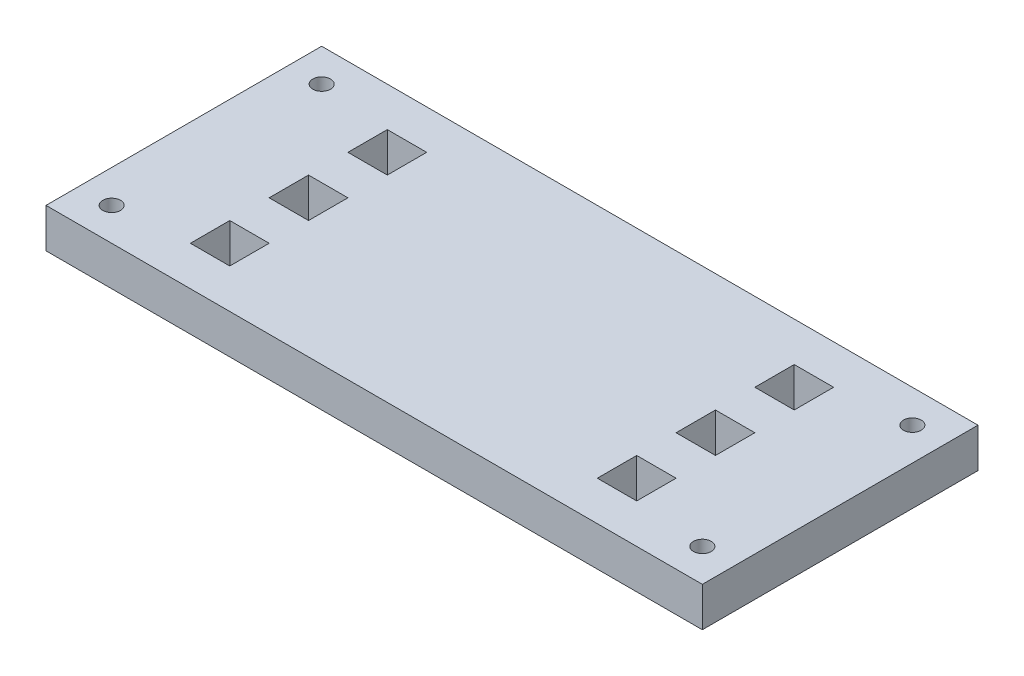
ISO-10303-21;
HEADER;
FILE_DESCRIPTION(('STEP AP214'),'2;1');
FILE_NAME('part.step','',(''),(''),'','','');
FILE_SCHEMA(('AUTOMOTIVE_DESIGN { 1 0 10303 214 1 1 1 1 }'));
ENDSEC;
DATA;
#1=APPLICATION_CONTEXT('core data for automotive mechanical design processes');
#2=APPLICATION_PROTOCOL_DEFINITION('international standard','automotive_design',2000,#1);
#3=PRODUCT_CONTEXT('',#1,'mechanical');
#4=PRODUCT('Part','Part','',(#3));
#5=PRODUCT_RELATED_PRODUCT_CATEGORY('part','',(#4));
#6=PRODUCT_DEFINITION_FORMATION('','',#4);
#7=PRODUCT_DEFINITION_CONTEXT('part definition',#1,'design');
#8=PRODUCT_DEFINITION('design','',#6,#7);
#9=PRODUCT_DEFINITION_SHAPE('','',#8);
#10=(LENGTH_UNIT() NAMED_UNIT(*) SI_UNIT(.MILLI.,.METRE.));
#11=(NAMED_UNIT(*) PLANE_ANGLE_UNIT() SI_UNIT($,.RADIAN.));
#12=(NAMED_UNIT(*) SI_UNIT($,.STERADIAN.) SOLID_ANGLE_UNIT());
#13=UNCERTAINTY_MEASURE_WITH_UNIT(LENGTH_MEASURE(1.E-05),#10,'distance_accuracy_value','');
#14=(GEOMETRIC_REPRESENTATION_CONTEXT(3) GLOBAL_UNCERTAINTY_ASSIGNED_CONTEXT((#13)) GLOBAL_UNIT_ASSIGNED_CONTEXT((#10,
#11,#12)) REPRESENTATION_CONTEXT('',''));
#15=CARTESIAN_POINT('',(0.,0.,0.));
#16=DIRECTION('',(0.,0.,1.));
#17=DIRECTION('',(1.,0.,0.));
#18=AXIS2_PLACEMENT_3D('',#15,#16,#17);
#19=CARTESIAN_POINT('',(0.,6.,0.));
#20=DIRECTION('',(0.,1.,0.));
#21=DIRECTION('',(0.,0.,1.));
#22=AXIS2_PLACEMENT_3D('',#19,#20,#21);
#23=PLANE('',#22);
#24=CARTESIAN_POINT('',(45.,6.,16.));
#25=DIRECTION('',(0.,1.,0.));
#26=DIRECTION('',(0.,0.,-1.));
#27=AXIS2_PLACEMENT_3D('',#24,#25,#26);
#28=CIRCLE('',#27,1.35);
#29=CARTESIAN_POINT('',(45.,6.,14.65));
#30=VERTEX_POINT('',#29);
#31=EDGE_CURVE('E757',#30,#30,#28,.T.);
#32=ORIENTED_EDGE('',*,*,#31,.F.);
#33=EDGE_LOOP('',(#32));
#34=FACE_BOUND('',#33,.T.);
#35=CARTESIAN_POINT('',(-45.,6.,-16.));
#36=DIRECTION('',(0.,1.,0.));
#37=DIRECTION('',(0.,0.,-1.));
#38=AXIS2_PLACEMENT_3D('',#35,#36,#37);
#39=CIRCLE('',#38,1.35);
#40=CARTESIAN_POINT('',(-45.,6.,-17.35));
#41=VERTEX_POINT('',#40);
#42=EDGE_CURVE('E247',#41,#41,#39,.T.);
#43=ORIENTED_EDGE('',*,*,#42,.F.);
#44=EDGE_LOOP('',(#43));
#45=FACE_BOUND('',#44,.T.);
#46=DIRECTION('',(0.,0.,-1.));
#47=VECTOR('',#46,1.);
#48=CARTESIAN_POINT('',(50.,6.,-21.));
#49=LINE('',#48,#47);
#50=CARTESIAN_POINT('',(50.,6.,21.));
#51=VERTEX_POINT('',#50);
#52=CARTESIAN_POINT('',(50.,6.,-21.));
#53=VERTEX_POINT('',#52);
#54=EDGE_CURVE('E412',#51,#53,#49,.T.);
#55=ORIENTED_EDGE('',*,*,#54,.T.);
#56=DIRECTION('',(-1.,0.,0.));
#57=VECTOR('',#56,1.);
#58=CARTESIAN_POINT('',(-50.,6.,-21.));
#59=LINE('',#58,#57);
#60=CARTESIAN_POINT('',(-50.,6.,-21.));
#61=VERTEX_POINT('',#60);
#62=EDGE_CURVE('E415',#53,#61,#59,.T.);
#63=ORIENTED_EDGE('',*,*,#62,.T.);
#64=DIRECTION('',(0.,0.,1.));
#65=VECTOR('',#64,1.);
#66=CARTESIAN_POINT('',(-50.,6.,-21.));
#67=LINE('',#66,#65);
#68=CARTESIAN_POINT('',(-50.,6.,21.));
#69=VERTEX_POINT('',#68);
#70=EDGE_CURVE('E418',#61,#69,#67,.T.);
#71=ORIENTED_EDGE('',*,*,#70,.T.);
#72=DIRECTION('',(1.,0.,0.));
#73=VECTOR('',#72,1.);
#74=CARTESIAN_POINT('',(-50.,6.,21.));
#75=LINE('',#74,#73);
#76=EDGE_CURVE('E420',#69,#51,#75,.T.);
#77=ORIENTED_EDGE('',*,*,#76,.T.);
#78=EDGE_LOOP('',(#55,#63,#71,#77));
#79=FACE_BOUND('',#78,.T.);
#80=DIRECTION('',(1.,0.,0.));
#81=VECTOR('',#80,1.);
#82=CARTESIAN_POINT('',(-34.,6.,15.));
#83=LINE('',#82,#81);
#84=CARTESIAN_POINT('',(-34.,6.,15.));
#85=VERTEX_POINT('',#84);
#86=CARTESIAN_POINT('',(-28.,6.,15.));
#87=VERTEX_POINT('',#86);
#88=EDGE_CURVE('E383',#85,#87,#83,.T.);
#89=ORIENTED_EDGE('',*,*,#88,.F.);
#90=DIRECTION('',(0.,0.,1.));
#91=VECTOR('',#90,1.);
#92=CARTESIAN_POINT('',(-34.,6.,15.));
#93=LINE('',#92,#91);
#94=CARTESIAN_POINT('',(-34.,6.,9.));
#95=VERTEX_POINT('',#94);
#96=EDGE_CURVE('E381',#95,#85,#93,.T.);
#97=ORIENTED_EDGE('',*,*,#96,.F.);
#98=DIRECTION('',(-1.,0.,0.));
#99=VECTOR('',#98,1.);
#100=CARTESIAN_POINT('',(-34.,6.,9.));
#101=LINE('',#100,#99);
#102=CARTESIAN_POINT('',(-28.,6.,9.));
#103=VERTEX_POINT('',#102);
#104=EDGE_CURVE('E389',#103,#95,#101,.T.);
#105=ORIENTED_EDGE('',*,*,#104,.F.);
#106=DIRECTION('',(0.,0.,-1.));
#107=VECTOR('',#106,1.);
#108=CARTESIAN_POINT('',(-28.,6.,15.));
#109=LINE('',#108,#107);
#110=EDGE_CURVE('E386',#87,#103,#109,.T.);
#111=ORIENTED_EDGE('',*,*,#110,.F.);
#112=EDGE_LOOP('',(#89,#97,#105,#111));
#113=FACE_BOUND('',#112,.T.);
#114=DIRECTION('',(1.,0.,0.));
#115=VECTOR('',#114,1.);
#116=CARTESIAN_POINT('',(-34.,6.,3.));
#117=LINE('',#116,#115);
#118=CARTESIAN_POINT('',(-34.,6.,3.));
#119=VERTEX_POINT('',#118);
#120=CARTESIAN_POINT('',(-28.,6.,3.));
#121=VERTEX_POINT('',#120);
#122=EDGE_CURVE('E352',#119,#121,#117,.T.);
#123=ORIENTED_EDGE('',*,*,#122,.F.);
#124=DIRECTION('',(0.,0.,1.));
#125=VECTOR('',#124,1.);
#126=CARTESIAN_POINT('',(-34.,6.,3.));
#127=LINE('',#126,#125);
#128=CARTESIAN_POINT('',(-34.,6.,-3.));
#129=VERTEX_POINT('',#128);
#130=EDGE_CURVE('E350',#129,#119,#127,.T.);
#131=ORIENTED_EDGE('',*,*,#130,.F.);
#132=DIRECTION('',(-1.,0.,0.));
#133=VECTOR('',#132,1.);
#134=CARTESIAN_POINT('',(-34.,6.,-3.));
#135=LINE('',#134,#133);
#136=CARTESIAN_POINT('',(-28.,6.,-3.));
#137=VERTEX_POINT('',#136);
#138=EDGE_CURVE('E358',#137,#129,#135,.T.);
#139=ORIENTED_EDGE('',*,*,#138,.F.);
#140=DIRECTION('',(0.,0.,-1.));
#141=VECTOR('',#140,1.);
#142=CARTESIAN_POINT('',(-28.,6.,3.));
#143=LINE('',#142,#141);
#144=EDGE_CURVE('E355',#121,#137,#143,.T.);
#145=ORIENTED_EDGE('',*,*,#144,.F.);
#146=EDGE_LOOP('',(#123,#131,#139,#145));
#147=FACE_BOUND('',#146,.T.);
#148=DIRECTION('',(1.,0.,0.));
#149=VECTOR('',#148,1.);
#150=CARTESIAN_POINT('',(-34.,6.,-9.));
#151=LINE('',#150,#149);
#152=CARTESIAN_POINT('',(-34.,6.,-9.));
#153=VERTEX_POINT('',#152);
#154=CARTESIAN_POINT('',(-28.,6.,-9.));
#155=VERTEX_POINT('',#154);
#156=EDGE_CURVE('E321',#153,#155,#151,.T.);
#157=ORIENTED_EDGE('',*,*,#156,.F.);
#158=DIRECTION('',(0.,0.,1.));
#159=VECTOR('',#158,1.);
#160=CARTESIAN_POINT('',(-34.,6.,-9.));
#161=LINE('',#160,#159);
#162=CARTESIAN_POINT('',(-34.,6.,-15.));
#163=VERTEX_POINT('',#162);
#164=EDGE_CURVE('E319',#163,#153,#161,.T.);
#165=ORIENTED_EDGE('',*,*,#164,.F.);
#166=DIRECTION('',(-1.,0.,0.));
#167=VECTOR('',#166,1.);
#168=CARTESIAN_POINT('',(-34.,6.,-15.));
#169=LINE('',#168,#167);
#170=CARTESIAN_POINT('',(-28.,6.,-15.));
#171=VERTEX_POINT('',#170);
#172=EDGE_CURVE('E327',#171,#163,#169,.T.);
#173=ORIENTED_EDGE('',*,*,#172,.F.);
#174=DIRECTION('',(0.,0.,-1.));
#175=VECTOR('',#174,1.);
#176=CARTESIAN_POINT('',(-28.,6.,-9.));
#177=LINE('',#176,#175);
#178=EDGE_CURVE('E324',#155,#171,#177,.T.);
#179=ORIENTED_EDGE('',*,*,#178,.F.);
#180=EDGE_LOOP('',(#157,#165,#173,#179));
#181=FACE_BOUND('',#180,.T.);
#182=DIRECTION('',(-1.,0.,0.));
#183=VECTOR('',#182,1.);
#184=CARTESIAN_POINT('',(34.,6.,8.99999999999997));
#185=LINE('',#184,#183);
#186=CARTESIAN_POINT('',(34.,6.,8.99999999999997));
#187=VERTEX_POINT('',#186);
#188=CARTESIAN_POINT('',(28.,6.,8.99999999999997));
#189=VERTEX_POINT('',#188);
#190=EDGE_CURVE('E290',#187,#189,#185,.T.);
#191=ORIENTED_EDGE('',*,*,#190,.F.);
#192=DIRECTION('',(0.,0.,-1.));
#193=VECTOR('',#192,1.);
#194=CARTESIAN_POINT('',(34.,6.,15.));
#195=LINE('',#194,#193);
#196=CARTESIAN_POINT('',(34.,6.,15.));
#197=VERTEX_POINT('',#196);
#198=EDGE_CURVE('E288',#197,#187,#195,.T.);
#199=ORIENTED_EDGE('',*,*,#198,.F.);
#200=DIRECTION('',(1.,0.,0.));
#201=VECTOR('',#200,1.);
#202=CARTESIAN_POINT('',(34.,6.,15.));
#203=LINE('',#202,#201);
#204=CARTESIAN_POINT('',(28.,6.,15.));
#205=VERTEX_POINT('',#204);
#206=EDGE_CURVE('E296',#205,#197,#203,.T.);
#207=ORIENTED_EDGE('',*,*,#206,.F.);
#208=DIRECTION('',(0.,0.,1.));
#209=VECTOR('',#208,1.);
#210=CARTESIAN_POINT('',(28.,6.,15.));
#211=LINE('',#210,#209);
#212=EDGE_CURVE('E293',#189,#205,#211,.T.);
#213=ORIENTED_EDGE('',*,*,#212,.F.);
#214=EDGE_LOOP('',(#191,#199,#207,#213));
#215=FACE_BOUND('',#214,.T.);
#216=DIRECTION('',(-1.,0.,0.));
#217=VECTOR('',#216,1.);
#218=CARTESIAN_POINT('',(34.,6.,-3.00000000000001));
#219=LINE('',#218,#217);
#220=CARTESIAN_POINT('',(34.,6.,-3.00000000000001));
#221=VERTEX_POINT('',#220);
#222=CARTESIAN_POINT('',(28.,6.,-3.00000000000001));
#223=VERTEX_POINT('',#222);
#224=EDGE_CURVE('E259',#221,#223,#219,.T.);
#225=ORIENTED_EDGE('',*,*,#224,.F.);
#226=DIRECTION('',(0.,0.,-1.));
#227=VECTOR('',#226,1.);
#228=CARTESIAN_POINT('',(34.,6.,2.99999999999999));
#229=LINE('',#228,#227);
#230=CARTESIAN_POINT('',(34.,6.,2.99999999999999));
#231=VERTEX_POINT('',#230);
#232=EDGE_CURVE('E257',#231,#221,#229,.T.);
#233=ORIENTED_EDGE('',*,*,#232,.F.);
#234=DIRECTION('',(1.,0.,0.));
#235=VECTOR('',#234,1.);
#236=CARTESIAN_POINT('',(34.,6.,2.99999999999999));
#237=LINE('',#236,#235);
#238=CARTESIAN_POINT('',(28.,6.,2.99999999999999));
#239=VERTEX_POINT('',#238);
#240=EDGE_CURVE('E265',#239,#231,#237,.T.);
#241=ORIENTED_EDGE('',*,*,#240,.F.);
#242=DIRECTION('',(0.,0.,1.));
#243=VECTOR('',#242,1.);
#244=CARTESIAN_POINT('',(28.,6.,2.99999999999999));
#245=LINE('',#244,#243);
#246=EDGE_CURVE('E262',#223,#239,#245,.T.);
#247=ORIENTED_EDGE('',*,*,#246,.F.);
#248=EDGE_LOOP('',(#225,#233,#241,#247));
#249=FACE_BOUND('',#248,.T.);
#250=DIRECTION('',(-1.,0.,0.));
#251=VECTOR('',#250,1.);
#252=CARTESIAN_POINT('',(34.,6.,-15.));
#253=LINE('',#252,#251);
#254=CARTESIAN_POINT('',(34.,6.,-15.));
#255=VERTEX_POINT('',#254);
#256=CARTESIAN_POINT('',(28.,6.,-15.));
#257=VERTEX_POINT('',#256);
#258=EDGE_CURVE('E226',#255,#257,#253,.T.);
#259=ORIENTED_EDGE('',*,*,#258,.F.);
#260=DIRECTION('',(0.,0.,-1.));
#261=VECTOR('',#260,1.);
#262=CARTESIAN_POINT('',(34.,6.,-9.00000000000001));
#263=LINE('',#262,#261);
#264=CARTESIAN_POINT('',(34.,6.,-9.00000000000001));
#265=VERTEX_POINT('',#264);
#266=EDGE_CURVE('E218',#265,#255,#263,.T.);
#267=ORIENTED_EDGE('',*,*,#266,.F.);
#268=DIRECTION('',(1.,0.,0.));
#269=VECTOR('',#268,1.);
#270=CARTESIAN_POINT('',(34.,6.,-9.00000000000001));
#271=LINE('',#270,#269);
#272=CARTESIAN_POINT('',(28.,6.,-9.00000000000001));
#273=VERTEX_POINT('',#272);
#274=EDGE_CURVE('E241',#273,#265,#271,.T.);
#275=ORIENTED_EDGE('',*,*,#274,.F.);
#276=DIRECTION('',(0.,0.,1.));
#277=VECTOR('',#276,1.);
#278=CARTESIAN_POINT('',(28.,6.,-9.00000000000001));
#279=LINE('',#278,#277);
#280=EDGE_CURVE('E239',#257,#273,#279,.T.);
#281=ORIENTED_EDGE('',*,*,#280,.F.);
#282=EDGE_LOOP('',(#259,#267,#275,#281));
#283=FACE_BOUND('',#282,.T.);
#284=CARTESIAN_POINT('',(45.,6.,-16.));
#285=DIRECTION('',(0.,1.,0.));
#286=DIRECTION('',(0.,0.,1.));
#287=AXIS2_PLACEMENT_3D('',#284,#285,#286);
#288=CIRCLE('',#287,1.35);
#289=CARTESIAN_POINT('',(45.,6.,-14.65));
#290=VERTEX_POINT('',#289);
#291=EDGE_CURVE('E763',#290,#290,#288,.T.);
#292=ORIENTED_EDGE('',*,*,#291,.F.);
#293=EDGE_LOOP('',(#292));
#294=FACE_BOUND('',#293,.T.);
#295=CARTESIAN_POINT('',(-45.,6.,16.));
#296=DIRECTION('',(0.,1.,0.));
#297=DIRECTION('',(0.,0.,1.));
#298=AXIS2_PLACEMENT_3D('',#295,#296,#297);
#299=CIRCLE('',#298,1.35);
#300=CARTESIAN_POINT('',(-45.,6.,17.35));
#301=VERTEX_POINT('',#300);
#302=EDGE_CURVE('E748',#301,#301,#299,.T.);
#303=ORIENTED_EDGE('',*,*,#302,.F.);
#304=EDGE_LOOP('',(#303));
#305=FACE_BOUND('',#304,.T.);
#306=ADVANCED_FACE('F33',(#34,#45,#79,#113,#147,#181,#215,#249,#283,#294,#305),#23,.T.);
#307=CARTESIAN_POINT('',(0.,0.,0.));
#308=DIRECTION('',(0.,1.,0.));
#309=DIRECTION('',(0.,0.,1.));
#310=AXIS2_PLACEMENT_3D('',#307,#308,#309);
#311=PLANE('',#310);
#312=DIRECTION('',(0.,0.,-1.));
#313=VECTOR('',#312,1.);
#314=CARTESIAN_POINT('',(34.,0.,2.99999999999999));
#315=LINE('',#314,#313);
#316=CARTESIAN_POINT('',(34.,0.,2.99999999999999));
#317=VERTEX_POINT('',#316);
#318=CARTESIAN_POINT('',(34.,0.,-3.00000000000001));
#319=VERTEX_POINT('',#318);
#320=EDGE_CURVE('E234',#317,#319,#315,.T.);
#321=ORIENTED_EDGE('',*,*,#320,.T.);
#322=DIRECTION('',(-1.,0.,0.));
#323=VECTOR('',#322,1.);
#324=CARTESIAN_POINT('',(34.,0.,-3.00000000000001));
#325=LINE('',#324,#323);
#326=CARTESIAN_POINT('',(28.,0.,-3.00000000000001));
#327=VERTEX_POINT('',#326);
#328=EDGE_CURVE('E270',#319,#327,#325,.T.);
#329=ORIENTED_EDGE('',*,*,#328,.T.);
#330=DIRECTION('',(0.,0.,1.));
#331=VECTOR('',#330,1.);
#332=CARTESIAN_POINT('',(28.,0.,2.99999999999999));
#333=LINE('',#332,#331);
#334=CARTESIAN_POINT('',(28.,0.,2.99999999999999));
#335=VERTEX_POINT('',#334);
#336=EDGE_CURVE('E273',#327,#335,#333,.T.);
#337=ORIENTED_EDGE('',*,*,#336,.T.);
#338=DIRECTION('',(1.,0.,0.));
#339=VECTOR('',#338,1.);
#340=CARTESIAN_POINT('',(34.,0.,2.99999999999999));
#341=LINE('',#340,#339);
#342=EDGE_CURVE('E260',#335,#317,#341,.T.);
#343=ORIENTED_EDGE('',*,*,#342,.T.);
#344=EDGE_LOOP('',(#321,#329,#337,#343));
#345=FACE_BOUND('',#344,.T.);
#346=DIRECTION('',(0.,0.,1.));
#347=VECTOR('',#346,1.);
#348=CARTESIAN_POINT('',(-34.,0.,-9.));
#349=LINE('',#348,#347);
#350=CARTESIAN_POINT('',(-34.,0.,-15.));
#351=VERTEX_POINT('',#350);
#352=CARTESIAN_POINT('',(-34.,0.,-9.));
#353=VERTEX_POINT('',#352);
#354=EDGE_CURVE('E318',#351,#353,#349,.T.);
#355=ORIENTED_EDGE('',*,*,#354,.T.);
#356=DIRECTION('',(1.,0.,0.));
#357=VECTOR('',#356,1.);
#358=CARTESIAN_POINT('',(-34.,0.,-9.));
#359=LINE('',#358,#357);
#360=CARTESIAN_POINT('',(-28.,0.,-9.));
#361=VERTEX_POINT('',#360);
#362=EDGE_CURVE('E332',#353,#361,#359,.T.);
#363=ORIENTED_EDGE('',*,*,#362,.T.);
#364=DIRECTION('',(0.,0.,-1.));
#365=VECTOR('',#364,1.);
#366=CARTESIAN_POINT('',(-28.,0.,-9.));
#367=LINE('',#366,#365);
#368=CARTESIAN_POINT('',(-28.,0.,-15.));
#369=VERTEX_POINT('',#368);
#370=EDGE_CURVE('E335',#361,#369,#367,.T.);
#371=ORIENTED_EDGE('',*,*,#370,.T.);
#372=DIRECTION('',(-1.,0.,0.));
#373=VECTOR('',#372,1.);
#374=CARTESIAN_POINT('',(-34.,0.,-15.));
#375=LINE('',#374,#373);
#376=EDGE_CURVE('E322',#369,#351,#375,.T.);
#377=ORIENTED_EDGE('',*,*,#376,.T.);
#378=EDGE_LOOP('',(#355,#363,#371,#377));
#379=FACE_BOUND('',#378,.T.);
#380=DIRECTION('',(0.,0.,1.));
#381=VECTOR('',#380,1.);
#382=CARTESIAN_POINT('',(-34.,0.,15.));
#383=LINE('',#382,#381);
#384=CARTESIAN_POINT('',(-34.,0.,9.));
#385=VERTEX_POINT('',#384);
#386=CARTESIAN_POINT('',(-34.,0.,15.));
#387=VERTEX_POINT('',#386);
#388=EDGE_CURVE('E380',#385,#387,#383,.T.);
#389=ORIENTED_EDGE('',*,*,#388,.T.);
#390=DIRECTION('',(1.,0.,0.));
#391=VECTOR('',#390,1.);
#392=CARTESIAN_POINT('',(-34.,0.,15.));
#393=LINE('',#392,#391);
#394=CARTESIAN_POINT('',(-28.,0.,15.));
#395=VERTEX_POINT('',#394);
#396=EDGE_CURVE('E394',#387,#395,#393,.T.);
#397=ORIENTED_EDGE('',*,*,#396,.T.);
#398=DIRECTION('',(0.,0.,-1.));
#399=VECTOR('',#398,1.);
#400=CARTESIAN_POINT('',(-28.,0.,15.));
#401=LINE('',#400,#399);
#402=CARTESIAN_POINT('',(-28.,0.,9.));
#403=VERTEX_POINT('',#402);
#404=EDGE_CURVE('E397',#395,#403,#401,.T.);
#405=ORIENTED_EDGE('',*,*,#404,.T.);
#406=DIRECTION('',(-1.,0.,0.));
#407=VECTOR('',#406,1.);
#408=CARTESIAN_POINT('',(-34.,0.,9.));
#409=LINE('',#408,#407);
#410=EDGE_CURVE('E384',#403,#385,#409,.T.);
#411=ORIENTED_EDGE('',*,*,#410,.T.);
#412=EDGE_LOOP('',(#389,#397,#405,#411));
#413=FACE_BOUND('',#412,.T.);
#414=DIRECTION('',(0.,0.,-1.));
#415=VECTOR('',#414,1.);
#416=CARTESIAN_POINT('',(50.,0.,-21.));
#417=LINE('',#416,#415);
#418=CARTESIAN_POINT('',(50.,0.,21.));
#419=VERTEX_POINT('',#418);
#420=CARTESIAN_POINT('',(50.,0.,-21.));
#421=VERTEX_POINT('',#420);
#422=EDGE_CURVE('E411',#419,#421,#417,.T.);
#423=ORIENTED_EDGE('',*,*,#422,.F.);
#424=DIRECTION('',(1.,0.,0.));
#425=VECTOR('',#424,1.);
#426=CARTESIAN_POINT('',(-50.,0.,21.));
#427=LINE('',#426,#425);
#428=CARTESIAN_POINT('',(-50.,0.,21.));
#429=VERTEX_POINT('',#428);
#430=EDGE_CURVE('E416',#429,#419,#427,.T.);
#431=ORIENTED_EDGE('',*,*,#430,.F.);
#432=DIRECTION('',(0.,0.,1.));
#433=VECTOR('',#432,1.);
#434=CARTESIAN_POINT('',(-50.,0.,-21.));
#435=LINE('',#434,#433);
#436=CARTESIAN_POINT('',(-50.,0.,-21.));
#437=VERTEX_POINT('',#436);
#438=EDGE_CURVE('E427',#437,#429,#435,.T.);
#439=ORIENTED_EDGE('',*,*,#438,.F.);
#440=DIRECTION('',(-1.,0.,0.));
#441=VECTOR('',#440,1.);
#442=CARTESIAN_POINT('',(-50.,0.,-21.));
#443=LINE('',#442,#441);
#444=EDGE_CURVE('E425',#421,#437,#443,.T.);
#445=ORIENTED_EDGE('',*,*,#444,.F.);
#446=EDGE_LOOP('',(#423,#431,#439,#445));
#447=FACE_BOUND('',#446,.T.);
#448=DIRECTION('',(0.,0.,1.));
#449=VECTOR('',#448,1.);
#450=CARTESIAN_POINT('',(-34.,0.,3.));
#451=LINE('',#450,#449);
#452=CARTESIAN_POINT('',(-34.,0.,-3.));
#453=VERTEX_POINT('',#452);
#454=CARTESIAN_POINT('',(-34.,0.,3.));
#455=VERTEX_POINT('',#454);
#456=EDGE_CURVE('E349',#453,#455,#451,.T.);
#457=ORIENTED_EDGE('',*,*,#456,.T.);
#458=DIRECTION('',(1.,0.,0.));
#459=VECTOR('',#458,1.);
#460=CARTESIAN_POINT('',(-34.,0.,3.));
#461=LINE('',#460,#459);
#462=CARTESIAN_POINT('',(-28.,0.,3.));
#463=VERTEX_POINT('',#462);
#464=EDGE_CURVE('E363',#455,#463,#461,.T.);
#465=ORIENTED_EDGE('',*,*,#464,.T.);
#466=DIRECTION('',(0.,0.,-1.));
#467=VECTOR('',#466,1.);
#468=CARTESIAN_POINT('',(-28.,0.,3.));
#469=LINE('',#468,#467);
#470=CARTESIAN_POINT('',(-28.,0.,-3.));
#471=VERTEX_POINT('',#470);
#472=EDGE_CURVE('E366',#463,#471,#469,.T.);
#473=ORIENTED_EDGE('',*,*,#472,.T.);
#474=DIRECTION('',(-1.,0.,0.));
#475=VECTOR('',#474,1.);
#476=CARTESIAN_POINT('',(-34.,0.,-3.));
#477=LINE('',#476,#475);
#478=EDGE_CURVE('E353',#471,#453,#477,.T.);
#479=ORIENTED_EDGE('',*,*,#478,.T.);
#480=EDGE_LOOP('',(#457,#465,#473,#479));
#481=FACE_BOUND('',#480,.T.);
#482=DIRECTION('',(0.,0.,-1.));
#483=VECTOR('',#482,1.);
#484=CARTESIAN_POINT('',(34.,0.,15.));
#485=LINE('',#484,#483);
#486=CARTESIAN_POINT('',(34.,0.,15.));
#487=VERTEX_POINT('',#486);
#488=CARTESIAN_POINT('',(34.,0.,8.99999999999997));
#489=VERTEX_POINT('',#488);
#490=EDGE_CURVE('E287',#487,#489,#485,.T.);
#491=ORIENTED_EDGE('',*,*,#490,.T.);
#492=DIRECTION('',(-1.,0.,0.));
#493=VECTOR('',#492,1.);
#494=CARTESIAN_POINT('',(34.,0.,8.99999999999997));
#495=LINE('',#494,#493);
#496=CARTESIAN_POINT('',(28.,0.,8.99999999999997));
#497=VERTEX_POINT('',#496);
#498=EDGE_CURVE('E301',#489,#497,#495,.T.);
#499=ORIENTED_EDGE('',*,*,#498,.T.);
#500=DIRECTION('',(0.,0.,1.));
#501=VECTOR('',#500,1.);
#502=CARTESIAN_POINT('',(28.,0.,15.));
#503=LINE('',#502,#501);
#504=CARTESIAN_POINT('',(28.,0.,15.));
#505=VERTEX_POINT('',#504);
#506=EDGE_CURVE('E304',#497,#505,#503,.T.);
#507=ORIENTED_EDGE('',*,*,#506,.T.);
#508=DIRECTION('',(1.,0.,0.));
#509=VECTOR('',#508,1.);
#510=CARTESIAN_POINT('',(34.,0.,15.));
#511=LINE('',#510,#509);
#512=EDGE_CURVE('E291',#505,#487,#511,.T.);
#513=ORIENTED_EDGE('',*,*,#512,.T.);
#514=EDGE_LOOP('',(#491,#499,#507,#513));
#515=FACE_BOUND('',#514,.T.);
#516=DIRECTION('',(0.,0.,-1.));
#517=VECTOR('',#516,1.);
#518=CARTESIAN_POINT('',(34.,0.,-9.00000000000001));
#519=LINE('',#518,#517);
#520=CARTESIAN_POINT('',(34.,0.,-9.00000000000001));
#521=VERTEX_POINT('',#520);
#522=CARTESIAN_POINT('',(34.,0.,-15.));
#523=VERTEX_POINT('',#522);
#524=EDGE_CURVE('E56',#521,#523,#519,.T.);
#525=ORIENTED_EDGE('',*,*,#524,.T.);
#526=DIRECTION('',(-1.,0.,0.));
#527=VECTOR('',#526,1.);
#528=CARTESIAN_POINT('',(34.,0.,-15.));
#529=LINE('',#528,#527);
#530=CARTESIAN_POINT('',(28.,0.,-15.));
#531=VERTEX_POINT('',#530);
#532=EDGE_CURVE('E233',#523,#531,#529,.T.);
#533=ORIENTED_EDGE('',*,*,#532,.T.);
#534=DIRECTION('',(0.,0.,1.));
#535=VECTOR('',#534,1.);
#536=CARTESIAN_POINT('',(28.,0.,-9.00000000000001));
#537=LINE('',#536,#535);
#538=CARTESIAN_POINT('',(28.,0.,-9.00000000000001));
#539=VERTEX_POINT('',#538);
#540=EDGE_CURVE('E249',#531,#539,#537,.T.);
#541=ORIENTED_EDGE('',*,*,#540,.T.);
#542=DIRECTION('',(1.,0.,0.));
#543=VECTOR('',#542,1.);
#544=CARTESIAN_POINT('',(34.,0.,-9.00000000000001));
#545=LINE('',#544,#543);
#546=EDGE_CURVE('E227',#539,#521,#545,.T.);
#547=ORIENTED_EDGE('',*,*,#546,.T.);
#548=EDGE_LOOP('',(#525,#533,#541,#547));
#549=FACE_BOUND('',#548,.T.);
#550=CARTESIAN_POINT('',(-45.,0.,-16.));
#551=DIRECTION('',(0.,1.,0.));
#552=DIRECTION('',(0.,0.,-1.));
#553=AXIS2_PLACEMENT_3D('',#550,#551,#552);
#554=CIRCLE('',#553,1.35);
#555=CARTESIAN_POINT('',(-45.,0.,-17.35));
#556=VERTEX_POINT('',#555);
#557=EDGE_CURVE('E766',#556,#556,#554,.T.);
#558=ORIENTED_EDGE('',*,*,#557,.T.);
#559=EDGE_LOOP('',(#558));
#560=FACE_BOUND('',#559,.T.);
#561=CARTESIAN_POINT('',(45.,0.,-16.));
#562=DIRECTION('',(0.,1.,0.));
#563=DIRECTION('',(0.,0.,1.));
#564=AXIS2_PLACEMENT_3D('',#561,#562,#563);
#565=CIRCLE('',#564,1.35);
#566=CARTESIAN_POINT('',(45.,0.,-14.65));
#567=VERTEX_POINT('',#566);
#568=EDGE_CURVE('E760',#567,#567,#565,.T.);
#569=ORIENTED_EDGE('',*,*,#568,.T.);
#570=EDGE_LOOP('',(#569));
#571=FACE_BOUND('',#570,.T.);
#572=CARTESIAN_POINT('',(45.,0.,16.));
#573=DIRECTION('',(0.,1.,0.));
#574=DIRECTION('',(0.,0.,-1.));
#575=AXIS2_PLACEMENT_3D('',#572,#573,#574);
#576=CIRCLE('',#575,1.35);
#577=CARTESIAN_POINT('',(45.,0.,14.65));
#578=VERTEX_POINT('',#577);
#579=EDGE_CURVE('E754',#578,#578,#576,.T.);
#580=ORIENTED_EDGE('',*,*,#579,.T.);
#581=EDGE_LOOP('',(#580));
#582=FACE_BOUND('',#581,.T.);
#583=CARTESIAN_POINT('',(-45.,0.,16.));
#584=DIRECTION('',(0.,1.,0.));
#585=DIRECTION('',(0.,0.,1.));
#586=AXIS2_PLACEMENT_3D('',#583,#584,#585);
#587=CIRCLE('',#586,1.35);
#588=CARTESIAN_POINT('',(-45.,0.,17.35));
#589=VERTEX_POINT('',#588);
#590=EDGE_CURVE('E751',#589,#589,#587,.T.);
#591=ORIENTED_EDGE('',*,*,#590,.T.);
#592=EDGE_LOOP('',(#591));
#593=FACE_BOUND('',#592,.T.);
#594=ADVANCED_FACE('F445',(#345,#379,#413,#447,#481,#515,#549,#560,#571,#582,#593),#311,.F.);
#595=CARTESIAN_POINT('',(50.,6.,-21.));
#596=DIRECTION('',(-1.,0.,0.));
#597=DIRECTION('',(0.,0.,1.));
#598=AXIS2_PLACEMENT_3D('',#595,#596,#597);
#599=PLANE('',#598);
#600=ORIENTED_EDGE('',*,*,#422,.T.);
#601=DIRECTION('',(0.,-1.,0.));
#602=VECTOR('',#601,1.);
#603=CARTESIAN_POINT('',(50.,6.,-21.));
#604=LINE('',#603,#602);
#605=EDGE_CURVE('E11',#53,#421,#604,.T.);
#606=ORIENTED_EDGE('',*,*,#605,.F.);
#607=ORIENTED_EDGE('',*,*,#54,.F.);
#608=DIRECTION('',(0.,-1.,0.));
#609=VECTOR('',#608,1.);
#610=CARTESIAN_POINT('',(50.,6.,21.));
#611=LINE('',#610,#609);
#612=EDGE_CURVE('E422',#51,#419,#611,.T.);
#613=ORIENTED_EDGE('',*,*,#612,.T.);
#614=EDGE_LOOP('',(#600,#606,#607,#613));
#615=FACE_BOUND('',#614,.T.);
#616=ADVANCED_FACE('F35',(#615),#599,.F.);
#617=CARTESIAN_POINT('',(-50.,6.,-21.));
#618=DIRECTION('',(0.,0.,1.));
#619=DIRECTION('',(1.,0.,0.));
#620=AXIS2_PLACEMENT_3D('',#617,#618,#619);
#621=PLANE('',#620);
#622=ORIENTED_EDGE('',*,*,#444,.T.);
#623=DIRECTION('',(0.,-1.,0.));
#624=VECTOR('',#623,1.);
#625=CARTESIAN_POINT('',(-50.,6.,-21.));
#626=LINE('',#625,#624);
#627=EDGE_CURVE('E41',#61,#437,#626,.T.);
#628=ORIENTED_EDGE('',*,*,#627,.F.);
#629=ORIENTED_EDGE('',*,*,#62,.F.);
#630=ORIENTED_EDGE('',*,*,#605,.T.);
#631=EDGE_LOOP('',(#622,#628,#629,#630));
#632=FACE_BOUND('',#631,.T.);
#633=ADVANCED_FACE('F456',(#632),#621,.F.);
#634=CARTESIAN_POINT('',(-50.,6.,-21.));
#635=DIRECTION('',(1.,0.,0.));
#636=DIRECTION('',(0.,0.,-1.));
#637=AXIS2_PLACEMENT_3D('',#634,#635,#636);
#638=PLANE('',#637);
#639=ORIENTED_EDGE('',*,*,#438,.T.);
#640=DIRECTION('',(0.,-1.,0.));
#641=VECTOR('',#640,1.);
#642=CARTESIAN_POINT('',(-50.,6.,21.));
#643=LINE('',#642,#641);
#644=EDGE_CURVE('E432',#69,#429,#643,.T.);
#645=ORIENTED_EDGE('',*,*,#644,.F.);
#646=ORIENTED_EDGE('',*,*,#70,.F.);
#647=ORIENTED_EDGE('',*,*,#627,.T.);
#648=EDGE_LOOP('',(#639,#645,#646,#647));
#649=FACE_BOUND('',#648,.T.);
#650=ADVANCED_FACE('F439',(#649),#638,.F.);
#651=CARTESIAN_POINT('',(-50.,6.,21.));
#652=DIRECTION('',(0.,0.,-1.));
#653=DIRECTION('',(-1.,0.,0.));
#654=AXIS2_PLACEMENT_3D('',#651,#652,#653);
#655=PLANE('',#654);
#656=ORIENTED_EDGE('',*,*,#430,.T.);
#657=ORIENTED_EDGE('',*,*,#612,.F.);
#658=ORIENTED_EDGE('',*,*,#76,.F.);
#659=ORIENTED_EDGE('',*,*,#644,.T.);
#660=EDGE_LOOP('',(#656,#657,#658,#659));
#661=FACE_BOUND('',#660,.T.);
#662=ADVANCED_FACE('F449',(#661),#655,.F.);
#663=CARTESIAN_POINT('',(-34.,6.,15.));
#664=DIRECTION('',(1.,0.,0.));
#665=DIRECTION('',(0.,0.,-1.));
#666=AXIS2_PLACEMENT_3D('',#663,#664,#665);
#667=PLANE('',#666);
#668=ORIENTED_EDGE('',*,*,#388,.F.);
#669=DIRECTION('',(0.,-1.,0.));
#670=VECTOR('',#669,1.);
#671=CARTESIAN_POINT('',(-34.,6.,9.));
#672=LINE('',#671,#670);
#673=EDGE_CURVE('E391',#95,#385,#672,.T.);
#674=ORIENTED_EDGE('',*,*,#673,.F.);
#675=ORIENTED_EDGE('',*,*,#96,.T.);
#676=DIRECTION('',(0.,-1.,0.));
#677=VECTOR('',#676,1.);
#678=CARTESIAN_POINT('',(-34.,6.,15.));
#679=LINE('',#678,#677);
#680=EDGE_CURVE('E408',#85,#387,#679,.T.);
#681=ORIENTED_EDGE('',*,*,#680,.T.);
#682=EDGE_LOOP('',(#668,#674,#675,#681));
#683=FACE_BOUND('',#682,.T.);
#684=ADVANCED_FACE('F474',(#683),#667,.T.);
#685=CARTESIAN_POINT('',(-34.,6.,15.));
#686=DIRECTION('',(0.,0.,-1.));
#687=DIRECTION('',(-1.,0.,0.));
#688=AXIS2_PLACEMENT_3D('',#685,#686,#687);
#689=PLANE('',#688);
#690=ORIENTED_EDGE('',*,*,#396,.F.);
#691=ORIENTED_EDGE('',*,*,#680,.F.);
#692=ORIENTED_EDGE('',*,*,#88,.T.);
#693=DIRECTION('',(0.,-1.,0.));
#694=VECTOR('',#693,1.);
#695=CARTESIAN_POINT('',(-28.,6.,15.));
#696=LINE('',#695,#694);
#697=EDGE_CURVE('E406',#87,#395,#696,.T.);
#698=ORIENTED_EDGE('',*,*,#697,.T.);
#699=EDGE_LOOP('',(#690,#691,#692,#698));
#700=FACE_BOUND('',#699,.T.);
#701=ADVANCED_FACE('F481',(#700),#689,.T.);
#702=CARTESIAN_POINT('',(-28.,6.,15.));
#703=DIRECTION('',(-1.,0.,0.));
#704=DIRECTION('',(0.,0.,1.));
#705=AXIS2_PLACEMENT_3D('',#702,#703,#704);
#706=PLANE('',#705);
#707=ORIENTED_EDGE('',*,*,#404,.F.);
#708=ORIENTED_EDGE('',*,*,#697,.F.);
#709=ORIENTED_EDGE('',*,*,#110,.T.);
#710=DIRECTION('',(0.,-1.,0.));
#711=VECTOR('',#710,1.);
#712=CARTESIAN_POINT('',(-28.,6.,9.));
#713=LINE('',#712,#711);
#714=EDGE_CURVE('E404',#103,#403,#713,.T.);
#715=ORIENTED_EDGE('',*,*,#714,.T.);
#716=EDGE_LOOP('',(#707,#708,#709,#715));
#717=FACE_BOUND('',#716,.T.);
#718=ADVANCED_FACE('F486',(#717),#706,.T.);
#719=CARTESIAN_POINT('',(-34.,6.,9.));
#720=DIRECTION('',(0.,0.,1.));
#721=DIRECTION('',(1.,0.,0.));
#722=AXIS2_PLACEMENT_3D('',#719,#720,#721);
#723=PLANE('',#722);
#724=ORIENTED_EDGE('',*,*,#410,.F.);
#725=ORIENTED_EDGE('',*,*,#714,.F.);
#726=ORIENTED_EDGE('',*,*,#104,.T.);
#727=ORIENTED_EDGE('',*,*,#673,.T.);
#728=EDGE_LOOP('',(#724,#725,#726,#727));
#729=FACE_BOUND('',#728,.T.);
#730=ADVANCED_FACE('F494',(#729),#723,.T.);
#731=CARTESIAN_POINT('',(-34.,6.,3.));
#732=DIRECTION('',(1.,0.,0.));
#733=DIRECTION('',(0.,0.,-1.));
#734=AXIS2_PLACEMENT_3D('',#731,#732,#733);
#735=PLANE('',#734);
#736=ORIENTED_EDGE('',*,*,#456,.F.);
#737=DIRECTION('',(0.,-1.,0.));
#738=VECTOR('',#737,1.);
#739=CARTESIAN_POINT('',(-34.,6.,-3.));
#740=LINE('',#739,#738);
#741=EDGE_CURVE('E360',#129,#453,#740,.T.);
#742=ORIENTED_EDGE('',*,*,#741,.F.);
#743=ORIENTED_EDGE('',*,*,#130,.T.);
#744=DIRECTION('',(0.,-1.,0.));
#745=VECTOR('',#744,1.);
#746=CARTESIAN_POINT('',(-34.,6.,3.));
#747=LINE('',#746,#745);
#748=EDGE_CURVE('E377',#119,#455,#747,.T.);
#749=ORIENTED_EDGE('',*,*,#748,.T.);
#750=EDGE_LOOP('',(#736,#742,#743,#749));
#751=FACE_BOUND('',#750,.T.);
#752=ADVANCED_FACE('F589',(#751),#735,.T.);
#753=CARTESIAN_POINT('',(-34.,6.,3.));
#754=DIRECTION('',(0.,0.,-1.));
#755=DIRECTION('',(-1.,0.,0.));
#756=AXIS2_PLACEMENT_3D('',#753,#754,#755);
#757=PLANE('',#756);
#758=ORIENTED_EDGE('',*,*,#464,.F.);
#759=ORIENTED_EDGE('',*,*,#748,.F.);
#760=ORIENTED_EDGE('',*,*,#122,.T.);
#761=DIRECTION('',(0.,-1.,0.));
#762=VECTOR('',#761,1.);
#763=CARTESIAN_POINT('',(-28.,6.,3.));
#764=LINE('',#763,#762);
#765=EDGE_CURVE('E375',#121,#463,#764,.T.);
#766=ORIENTED_EDGE('',*,*,#765,.T.);
#767=EDGE_LOOP('',(#758,#759,#760,#766));
#768=FACE_BOUND('',#767,.T.);
#769=ADVANCED_FACE('F585',(#768),#757,.T.);
#770=CARTESIAN_POINT('',(-28.,6.,3.));
#771=DIRECTION('',(-1.,0.,0.));
#772=DIRECTION('',(0.,0.,1.));
#773=AXIS2_PLACEMENT_3D('',#770,#771,#772);
#774=PLANE('',#773);
#775=ORIENTED_EDGE('',*,*,#472,.F.);
#776=ORIENTED_EDGE('',*,*,#765,.F.);
#777=ORIENTED_EDGE('',*,*,#144,.T.);
#778=DIRECTION('',(0.,-1.,0.));
#779=VECTOR('',#778,1.);
#780=CARTESIAN_POINT('',(-28.,6.,-3.));
#781=LINE('',#780,#779);
#782=EDGE_CURVE('E373',#137,#471,#781,.T.);
#783=ORIENTED_EDGE('',*,*,#782,.T.);
#784=EDGE_LOOP('',(#775,#776,#777,#783));
#785=FACE_BOUND('',#784,.T.);
#786=ADVANCED_FACE('F581',(#785),#774,.T.);
#787=CARTESIAN_POINT('',(-34.,6.,-3.));
#788=DIRECTION('',(0.,0.,1.));
#789=DIRECTION('',(1.,0.,0.));
#790=AXIS2_PLACEMENT_3D('',#787,#788,#789);
#791=PLANE('',#790);
#792=ORIENTED_EDGE('',*,*,#478,.F.);
#793=ORIENTED_EDGE('',*,*,#782,.F.);
#794=ORIENTED_EDGE('',*,*,#138,.T.);
#795=ORIENTED_EDGE('',*,*,#741,.T.);
#796=EDGE_LOOP('',(#792,#793,#794,#795));
#797=FACE_BOUND('',#796,.T.);
#798=ADVANCED_FACE('F577',(#797),#791,.T.);
#799=CARTESIAN_POINT('',(-34.,6.,-9.));
#800=DIRECTION('',(1.,0.,0.));
#801=DIRECTION('',(0.,0.,-1.));
#802=AXIS2_PLACEMENT_3D('',#799,#800,#801);
#803=PLANE('',#802);
#804=ORIENTED_EDGE('',*,*,#354,.F.);
#805=DIRECTION('',(0.,-1.,0.));
#806=VECTOR('',#805,1.);
#807=CARTESIAN_POINT('',(-34.,6.,-15.));
#808=LINE('',#807,#806);
#809=EDGE_CURVE('E329',#163,#351,#808,.T.);
#810=ORIENTED_EDGE('',*,*,#809,.F.);
#811=ORIENTED_EDGE('',*,*,#164,.T.);
#812=DIRECTION('',(0.,-1.,0.));
#813=VECTOR('',#812,1.);
#814=CARTESIAN_POINT('',(-34.,6.,-9.));
#815=LINE('',#814,#813);
#816=EDGE_CURVE('E346',#153,#353,#815,.T.);
#817=ORIENTED_EDGE('',*,*,#816,.T.);
#818=EDGE_LOOP('',(#804,#810,#811,#817));
#819=FACE_BOUND('',#818,.T.);
#820=ADVANCED_FACE('F573',(#819),#803,.T.);
#821=CARTESIAN_POINT('',(-34.,6.,-9.));
#822=DIRECTION('',(0.,0.,-1.));
#823=DIRECTION('',(-1.,0.,0.));
#824=AXIS2_PLACEMENT_3D('',#821,#822,#823);
#825=PLANE('',#824);
#826=ORIENTED_EDGE('',*,*,#362,.F.);
#827=ORIENTED_EDGE('',*,*,#816,.F.);
#828=ORIENTED_EDGE('',*,*,#156,.T.);
#829=DIRECTION('',(0.,-1.,0.));
#830=VECTOR('',#829,1.);
#831=CARTESIAN_POINT('',(-28.,6.,-9.));
#832=LINE('',#831,#830);
#833=EDGE_CURVE('E344',#155,#361,#832,.T.);
#834=ORIENTED_EDGE('',*,*,#833,.T.);
#835=EDGE_LOOP('',(#826,#827,#828,#834));
#836=FACE_BOUND('',#835,.T.);
#837=ADVANCED_FACE('F569',(#836),#825,.T.);
#838=CARTESIAN_POINT('',(-28.,6.,-9.));
#839=DIRECTION('',(-1.,0.,0.));
#840=DIRECTION('',(0.,0.,1.));
#841=AXIS2_PLACEMENT_3D('',#838,#839,#840);
#842=PLANE('',#841);
#843=ORIENTED_EDGE('',*,*,#370,.F.);
#844=ORIENTED_EDGE('',*,*,#833,.F.);
#845=ORIENTED_EDGE('',*,*,#178,.T.);
#846=DIRECTION('',(0.,-1.,0.));
#847=VECTOR('',#846,1.);
#848=CARTESIAN_POINT('',(-28.,6.,-15.));
#849=LINE('',#848,#847);
#850=EDGE_CURVE('E342',#171,#369,#849,.T.);
#851=ORIENTED_EDGE('',*,*,#850,.T.);
#852=EDGE_LOOP('',(#843,#844,#845,#851));
#853=FACE_BOUND('',#852,.T.);
#854=ADVANCED_FACE('F565',(#853),#842,.T.);
#855=CARTESIAN_POINT('',(-34.,6.,-15.));
#856=DIRECTION('',(0.,0.,1.));
#857=DIRECTION('',(1.,0.,0.));
#858=AXIS2_PLACEMENT_3D('',#855,#856,#857);
#859=PLANE('',#858);
#860=ORIENTED_EDGE('',*,*,#376,.F.);
#861=ORIENTED_EDGE('',*,*,#850,.F.);
#862=ORIENTED_EDGE('',*,*,#172,.T.);
#863=ORIENTED_EDGE('',*,*,#809,.T.);
#864=EDGE_LOOP('',(#860,#861,#862,#863));
#865=FACE_BOUND('',#864,.T.);
#866=ADVANCED_FACE('F561',(#865),#859,.T.);
#867=CARTESIAN_POINT('',(34.,6.,15.));
#868=DIRECTION('',(-1.,0.,0.));
#869=DIRECTION('',(0.,0.,1.));
#870=AXIS2_PLACEMENT_3D('',#867,#868,#869);
#871=PLANE('',#870);
#872=ORIENTED_EDGE('',*,*,#490,.F.);
#873=DIRECTION('',(0.,-1.,0.));
#874=VECTOR('',#873,1.);
#875=CARTESIAN_POINT('',(34.,6.,15.));
#876=LINE('',#875,#874);
#877=EDGE_CURVE('E298',#197,#487,#876,.T.);
#878=ORIENTED_EDGE('',*,*,#877,.F.);
#879=ORIENTED_EDGE('',*,*,#198,.T.);
#880=DIRECTION('',(0.,-1.,0.));
#881=VECTOR('',#880,1.);
#882=CARTESIAN_POINT('',(34.,6.,8.99999999999997));
#883=LINE('',#882,#881);
#884=EDGE_CURVE('E315',#187,#489,#883,.T.);
#885=ORIENTED_EDGE('',*,*,#884,.T.);
#886=EDGE_LOOP('',(#872,#878,#879,#885));
#887=FACE_BOUND('',#886,.T.);
#888=ADVANCED_FACE('F557',(#887),#871,.T.);
#889=CARTESIAN_POINT('',(34.,6.,8.99999999999997));
#890=DIRECTION('',(0.,0.,1.));
#891=DIRECTION('',(1.,0.,0.));
#892=AXIS2_PLACEMENT_3D('',#889,#890,#891);
#893=PLANE('',#892);
#894=ORIENTED_EDGE('',*,*,#498,.F.);
#895=ORIENTED_EDGE('',*,*,#884,.F.);
#896=ORIENTED_EDGE('',*,*,#190,.T.);
#897=DIRECTION('',(0.,-1.,0.));
#898=VECTOR('',#897,1.);
#899=CARTESIAN_POINT('',(28.,6.,8.99999999999997));
#900=LINE('',#899,#898);
#901=EDGE_CURVE('E313',#189,#497,#900,.T.);
#902=ORIENTED_EDGE('',*,*,#901,.T.);
#903=EDGE_LOOP('',(#894,#895,#896,#902));
#904=FACE_BOUND('',#903,.T.);
#905=ADVANCED_FACE('F553',(#904),#893,.T.);
#906=CARTESIAN_POINT('',(28.,6.,15.));
#907=DIRECTION('',(1.,0.,0.));
#908=DIRECTION('',(0.,0.,-1.));
#909=AXIS2_PLACEMENT_3D('',#906,#907,#908);
#910=PLANE('',#909);
#911=ORIENTED_EDGE('',*,*,#506,.F.);
#912=ORIENTED_EDGE('',*,*,#901,.F.);
#913=ORIENTED_EDGE('',*,*,#212,.T.);
#914=DIRECTION('',(0.,-1.,0.));
#915=VECTOR('',#914,1.);
#916=CARTESIAN_POINT('',(28.,6.,15.));
#917=LINE('',#916,#915);
#918=EDGE_CURVE('E311',#205,#505,#917,.T.);
#919=ORIENTED_EDGE('',*,*,#918,.T.);
#920=EDGE_LOOP('',(#911,#912,#913,#919));
#921=FACE_BOUND('',#920,.T.);
#922=ADVANCED_FACE('F549',(#921),#910,.T.);
#923=CARTESIAN_POINT('',(34.,6.,15.));
#924=DIRECTION('',(0.,0.,-1.));
#925=DIRECTION('',(-1.,0.,0.));
#926=AXIS2_PLACEMENT_3D('',#923,#924,#925);
#927=PLANE('',#926);
#928=ORIENTED_EDGE('',*,*,#512,.F.);
#929=ORIENTED_EDGE('',*,*,#918,.F.);
#930=ORIENTED_EDGE('',*,*,#206,.T.);
#931=ORIENTED_EDGE('',*,*,#877,.T.);
#932=EDGE_LOOP('',(#928,#929,#930,#931));
#933=FACE_BOUND('',#932,.T.);
#934=ADVANCED_FACE('F546',(#933),#927,.T.);
#935=CARTESIAN_POINT('',(34.,6.,2.99999999999999));
#936=DIRECTION('',(-1.,0.,0.));
#937=DIRECTION('',(0.,0.,1.));
#938=AXIS2_PLACEMENT_3D('',#935,#936,#937);
#939=PLANE('',#938);
#940=ORIENTED_EDGE('',*,*,#320,.F.);
#941=DIRECTION('',(0.,-1.,0.));
#942=VECTOR('',#941,1.);
#943=CARTESIAN_POINT('',(34.,6.,2.99999999999999));
#944=LINE('',#943,#942);
#945=EDGE_CURVE('E267',#231,#317,#944,.T.);
#946=ORIENTED_EDGE('',*,*,#945,.F.);
#947=ORIENTED_EDGE('',*,*,#232,.T.);
#948=DIRECTION('',(0.,-1.,0.));
#949=VECTOR('',#948,1.);
#950=CARTESIAN_POINT('',(34.,6.,-3.00000000000001));
#951=LINE('',#950,#949);
#952=EDGE_CURVE('E284',#221,#319,#951,.T.);
#953=ORIENTED_EDGE('',*,*,#952,.T.);
#954=EDGE_LOOP('',(#940,#946,#947,#953));
#955=FACE_BOUND('',#954,.T.);
#956=ADVANCED_FACE('F528',(#955),#939,.T.);
#957=CARTESIAN_POINT('',(34.,6.,-3.00000000000001));
#958=DIRECTION('',(0.,0.,1.));
#959=DIRECTION('',(1.,0.,0.));
#960=AXIS2_PLACEMENT_3D('',#957,#958,#959);
#961=PLANE('',#960);
#962=ORIENTED_EDGE('',*,*,#328,.F.);
#963=ORIENTED_EDGE('',*,*,#952,.F.);
#964=ORIENTED_EDGE('',*,*,#224,.T.);
#965=DIRECTION('',(0.,-1.,0.));
#966=VECTOR('',#965,1.);
#967=CARTESIAN_POINT('',(28.,6.,-3.00000000000001));
#968=LINE('',#967,#966);
#969=EDGE_CURVE('E282',#223,#327,#968,.T.);
#970=ORIENTED_EDGE('',*,*,#969,.T.);
#971=EDGE_LOOP('',(#962,#963,#964,#970));
#972=FACE_BOUND('',#971,.T.);
#973=ADVANCED_FACE('F521',(#972),#961,.T.);
#974=CARTESIAN_POINT('',(28.,6.,2.99999999999999));
#975=DIRECTION('',(1.,0.,0.));
#976=DIRECTION('',(0.,0.,-1.));
#977=AXIS2_PLACEMENT_3D('',#974,#975,#976);
#978=PLANE('',#977);
#979=ORIENTED_EDGE('',*,*,#336,.F.);
#980=ORIENTED_EDGE('',*,*,#969,.F.);
#981=ORIENTED_EDGE('',*,*,#246,.T.);
#982=DIRECTION('',(0.,-1.,0.));
#983=VECTOR('',#982,1.);
#984=CARTESIAN_POINT('',(28.,6.,2.99999999999999));
#985=LINE('',#984,#983);
#986=EDGE_CURVE('E280',#239,#335,#985,.T.);
#987=ORIENTED_EDGE('',*,*,#986,.T.);
#988=EDGE_LOOP('',(#979,#980,#981,#987));
#989=FACE_BOUND('',#988,.T.);
#990=ADVANCED_FACE('F524',(#989),#978,.T.);
#991=CARTESIAN_POINT('',(34.,6.,2.99999999999999));
#992=DIRECTION('',(0.,0.,-1.));
#993=DIRECTION('',(-1.,0.,0.));
#994=AXIS2_PLACEMENT_3D('',#991,#992,#993);
#995=PLANE('',#994);
#996=ORIENTED_EDGE('',*,*,#342,.F.);
#997=ORIENTED_EDGE('',*,*,#986,.F.);
#998=ORIENTED_EDGE('',*,*,#240,.T.);
#999=ORIENTED_EDGE('',*,*,#945,.T.);
#1000=EDGE_LOOP('',(#996,#997,#998,#999));
#1001=FACE_BOUND('',#1000,.T.);
#1002=ADVANCED_FACE('F531',(#1001),#995,.T.);
#1003=CARTESIAN_POINT('',(34.,6.,-9.00000000000001));
#1004=DIRECTION('',(-1.,0.,0.));
#1005=DIRECTION('',(0.,0.,1.));
#1006=AXIS2_PLACEMENT_3D('',#1003,#1004,#1005);
#1007=PLANE('',#1006);
#1008=ORIENTED_EDGE('',*,*,#524,.F.);
#1009=DIRECTION('',(0.,-1.,0.));
#1010=VECTOR('',#1009,1.);
#1011=CARTESIAN_POINT('',(34.,6.,-9.00000000000001));
#1012=LINE('',#1011,#1010);
#1013=EDGE_CURVE('E222',#265,#521,#1012,.T.);
#1014=ORIENTED_EDGE('',*,*,#1013,.F.);
#1015=ORIENTED_EDGE('',*,*,#266,.T.);
#1016=DIRECTION('',(0.,-1.,0.));
#1017=VECTOR('',#1016,1.);
#1018=CARTESIAN_POINT('',(34.,6.,-15.));
#1019=LINE('',#1018,#1017);
#1020=EDGE_CURVE('E221',#255,#523,#1019,.T.);
#1021=ORIENTED_EDGE('',*,*,#1020,.T.);
#1022=EDGE_LOOP('',(#1008,#1014,#1015,#1021));
#1023=FACE_BOUND('',#1022,.T.);
#1024=ADVANCED_FACE('F220',(#1023),#1007,.T.);
#1025=CARTESIAN_POINT('',(34.,6.,-15.));
#1026=DIRECTION('',(0.,0.,1.));
#1027=DIRECTION('',(1.,0.,0.));
#1028=AXIS2_PLACEMENT_3D('',#1025,#1026,#1027);
#1029=PLANE('',#1028);
#1030=ORIENTED_EDGE('',*,*,#532,.F.);
#1031=ORIENTED_EDGE('',*,*,#1020,.F.);
#1032=ORIENTED_EDGE('',*,*,#258,.T.);
#1033=DIRECTION('',(0.,-1.,0.));
#1034=VECTOR('',#1033,1.);
#1035=CARTESIAN_POINT('',(28.,6.,-15.));
#1036=LINE('',#1035,#1034);
#1037=EDGE_CURVE('E235',#257,#531,#1036,.T.);
#1038=ORIENTED_EDGE('',*,*,#1037,.T.);
#1039=EDGE_LOOP('',(#1030,#1031,#1032,#1038));
#1040=FACE_BOUND('',#1039,.T.);
#1041=ADVANCED_FACE('F230',(#1040),#1029,.T.);
#1042=CARTESIAN_POINT('',(28.,6.,-9.00000000000001));
#1043=DIRECTION('',(1.,0.,0.));
#1044=DIRECTION('',(0.,0.,-1.));
#1045=AXIS2_PLACEMENT_3D('',#1042,#1043,#1044);
#1046=PLANE('',#1045);
#1047=ORIENTED_EDGE('',*,*,#540,.F.);
#1048=ORIENTED_EDGE('',*,*,#1037,.F.);
#1049=ORIENTED_EDGE('',*,*,#280,.T.);
#1050=DIRECTION('',(0.,-1.,0.));
#1051=VECTOR('',#1050,1.);
#1052=CARTESIAN_POINT('',(28.,6.,-9.00000000000001));
#1053=LINE('',#1052,#1051);
#1054=EDGE_CURVE('E48',#273,#539,#1053,.T.);
#1055=ORIENTED_EDGE('',*,*,#1054,.T.);
#1056=EDGE_LOOP('',(#1047,#1048,#1049,#1055));
#1057=FACE_BOUND('',#1056,.T.);
#1058=ADVANCED_FACE('F684',(#1057),#1046,.T.);
#1059=CARTESIAN_POINT('',(34.,6.,-9.00000000000001));
#1060=DIRECTION('',(0.,0.,-1.));
#1061=DIRECTION('',(-1.,0.,0.));
#1062=AXIS2_PLACEMENT_3D('',#1059,#1060,#1061);
#1063=PLANE('',#1062);
#1064=ORIENTED_EDGE('',*,*,#546,.F.);
#1065=ORIENTED_EDGE('',*,*,#1054,.F.);
#1066=ORIENTED_EDGE('',*,*,#274,.T.);
#1067=ORIENTED_EDGE('',*,*,#1013,.T.);
#1068=EDGE_LOOP('',(#1064,#1065,#1066,#1067));
#1069=FACE_BOUND('',#1068,.T.);
#1070=ADVANCED_FACE('F692',(#1069),#1063,.T.);
#1071=CARTESIAN_POINT('',(-45.,6.,-16.));
#1072=DIRECTION('',(0.,-1.,0.));
#1073=DIRECTION('',(0.,0.,-1.));
#1074=AXIS2_PLACEMENT_3D('',#1071,#1072,#1073);
#1075=CYLINDRICAL_SURFACE('',#1074,1.35);
#1076=ORIENTED_EDGE('',*,*,#42,.T.);
#1077=EDGE_LOOP('',(#1076));
#1078=FACE_BOUND('',#1077,.T.);
#1079=ORIENTED_EDGE('',*,*,#557,.F.);
#1080=EDGE_LOOP('',(#1079));
#1081=FACE_BOUND('',#1080,.T.);
#1082=ADVANCED_FACE('F702',(#1078,#1081),#1075,.F.);
#1083=CARTESIAN_POINT('',(45.,6.,-16.));
#1084=DIRECTION('',(0.,-1.,0.));
#1085=DIRECTION('',(0.,0.,-1.));
#1086=AXIS2_PLACEMENT_3D('',#1083,#1084,#1085);
#1087=CYLINDRICAL_SURFACE('',#1086,1.35);
#1088=ORIENTED_EDGE('',*,*,#291,.T.);
#1089=EDGE_LOOP('',(#1088));
#1090=FACE_BOUND('',#1089,.T.);
#1091=ORIENTED_EDGE('',*,*,#568,.F.);
#1092=EDGE_LOOP('',(#1091));
#1093=FACE_BOUND('',#1092,.T.);
#1094=ADVANCED_FACE('F711',(#1090,#1093),#1087,.F.);
#1095=CARTESIAN_POINT('',(45.,6.,16.));
#1096=DIRECTION('',(0.,-1.,0.));
#1097=DIRECTION('',(0.,0.,-1.));
#1098=AXIS2_PLACEMENT_3D('',#1095,#1096,#1097);
#1099=CYLINDRICAL_SURFACE('',#1098,1.35);
#1100=ORIENTED_EDGE('',*,*,#31,.T.);
#1101=EDGE_LOOP('',(#1100));
#1102=FACE_BOUND('',#1101,.T.);
#1103=ORIENTED_EDGE('',*,*,#579,.F.);
#1104=EDGE_LOOP('',(#1103));
#1105=FACE_BOUND('',#1104,.T.);
#1106=ADVANCED_FACE('F721',(#1102,#1105),#1099,.F.);
#1107=CARTESIAN_POINT('',(-45.,6.,16.));
#1108=DIRECTION('',(0.,-1.,0.));
#1109=DIRECTION('',(0.,0.,-1.));
#1110=AXIS2_PLACEMENT_3D('',#1107,#1108,#1109);
#1111=CYLINDRICAL_SURFACE('',#1110,1.35);
#1112=ORIENTED_EDGE('',*,*,#302,.T.);
#1113=EDGE_LOOP('',(#1112));
#1114=FACE_BOUND('',#1113,.T.);
#1115=ORIENTED_EDGE('',*,*,#590,.F.);
#1116=EDGE_LOOP('',(#1115));
#1117=FACE_BOUND('',#1116,.T.);
#1118=ADVANCED_FACE('F731',(#1114,#1117),#1111,.F.);
#1119=CLOSED_SHELL('',(#306,#594,#616,#633,#650,#662,#684,#701,#718,#730,#752,#769,#786,#798,
#820,#837,#854,#866,#888,#905,#922,#934,#956,#973,#990,#1002,#1024,#1041,#1058,#1070,#1082,
#1094,#1106,#1118));
#1120=MANIFOLD_SOLID_BREP('B2',#1119);
#1121=ADVANCED_BREP_SHAPE_REPRESENTATION('',(#18,#1120),#14);
#1122=SHAPE_DEFINITION_REPRESENTATION(#9,#1121);
ENDSEC;
END-ISO-10303-21;
